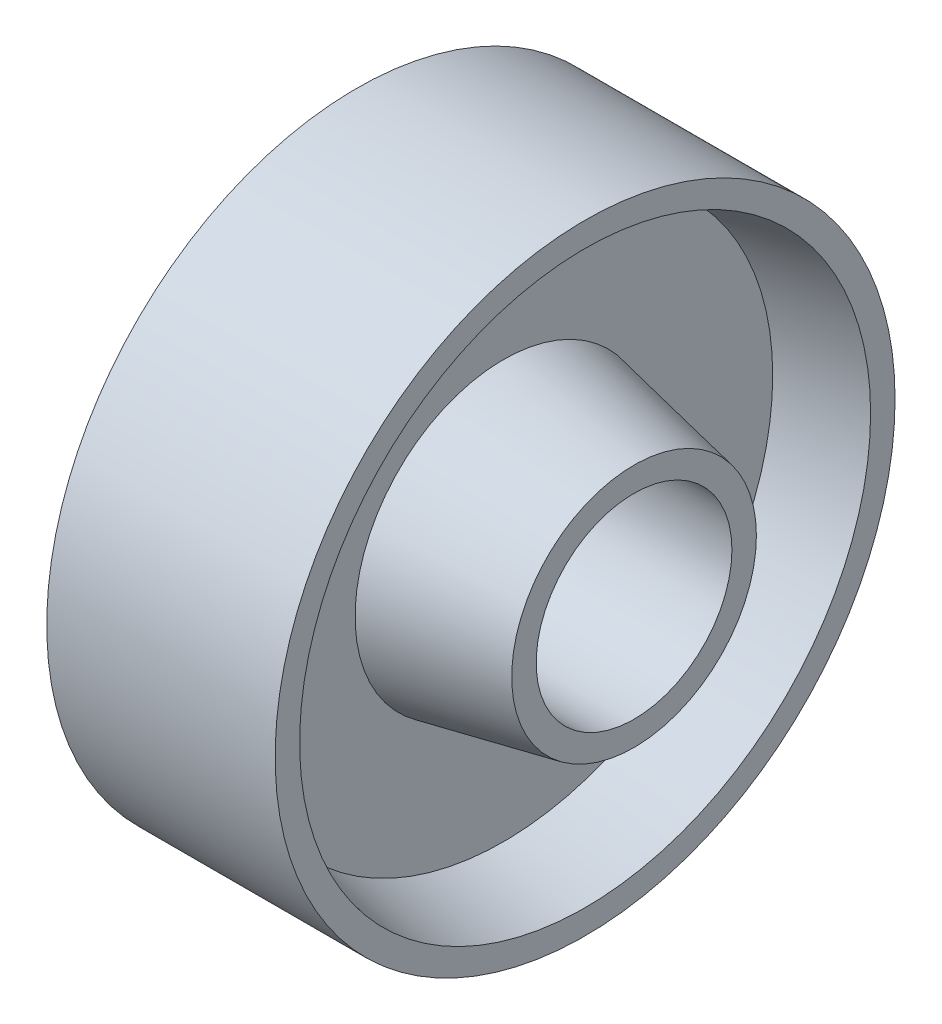
ISO-10303-21;
HEADER;
FILE_DESCRIPTION(('STEP AP214'),'2;1');
FILE_NAME('part.step','',(''),(''),'','','');
FILE_SCHEMA(('AUTOMOTIVE_DESIGN { 1 0 10303 214 1 1 1 1 }'));
ENDSEC;
DATA;
#1=APPLICATION_CONTEXT('core data for automotive mechanical design processes');
#2=APPLICATION_PROTOCOL_DEFINITION('international standard','automotive_design',2000,#1);
#3=PRODUCT_CONTEXT('',#1,'mechanical');
#4=PRODUCT('Part','Part','',(#3));
#5=PRODUCT_RELATED_PRODUCT_CATEGORY('part','',(#4));
#6=PRODUCT_DEFINITION_FORMATION('','',#4);
#7=PRODUCT_DEFINITION_CONTEXT('part definition',#1,'design');
#8=PRODUCT_DEFINITION('design','',#6,#7);
#9=PRODUCT_DEFINITION_SHAPE('','',#8);
#10=(LENGTH_UNIT() NAMED_UNIT(*) SI_UNIT(.MILLI.,.METRE.));
#11=(NAMED_UNIT(*) PLANE_ANGLE_UNIT() SI_UNIT($,.RADIAN.));
#12=(NAMED_UNIT(*) SI_UNIT($,.STERADIAN.) SOLID_ANGLE_UNIT());
#13=UNCERTAINTY_MEASURE_WITH_UNIT(LENGTH_MEASURE(1.E-05),#10,'distance_accuracy_value','');
#14=(GEOMETRIC_REPRESENTATION_CONTEXT(3) GLOBAL_UNCERTAINTY_ASSIGNED_CONTEXT((#13)) GLOBAL_UNIT_ASSIGNED_CONTEXT((#10,
#11,#12)) REPRESENTATION_CONTEXT('',''));
#15=CARTESIAN_POINT('',(0.,0.,0.));
#16=DIRECTION('',(0.,0.,1.));
#17=DIRECTION('',(1.,0.,0.));
#18=AXIS2_PLACEMENT_3D('',#15,#16,#17);
#19=CARTESIAN_POINT('',(20.,0.,0.));
#20=DIRECTION('',(-1.,0.,0.));
#21=DIRECTION('',(0.,0.,1.));
#22=AXIS2_PLACEMENT_3D('',#19,#20,#21);
#23=CONICAL_SURFACE('',#22,15.,0.197395559849881);
#24=CARTESIAN_POINT('',(4.,0.,0.));
#25=DIRECTION('',(1.,0.,0.));
#26=DIRECTION('',(0.,0.,-1.));
#27=AXIS2_PLACEMENT_3D('',#24,#25,#26);
#28=CIRCLE('',#27,18.2);
#29=CARTESIAN_POINT('',(4.,0.,-18.2));
#30=VERTEX_POINT('',#29);
#31=EDGE_CURVE('E71',#30,#30,#28,.T.);
#32=ORIENTED_EDGE('',*,*,#31,.T.);
#33=EDGE_LOOP('',(#32));
#34=FACE_BOUND('',#33,.T.);
#35=CARTESIAN_POINT('',(20.,0.,0.));
#36=DIRECTION('',(1.,0.,0.));
#37=DIRECTION('',(0.,0.,-1.));
#38=AXIS2_PLACEMENT_3D('',#35,#36,#37);
#39=CIRCLE('',#38,15.);
#40=CARTESIAN_POINT('',(20.,0.,-15.));
#41=VERTEX_POINT('',#40);
#42=EDGE_CURVE('E10',#41,#41,#39,.T.);
#43=ORIENTED_EDGE('',*,*,#42,.F.);
#44=EDGE_LOOP('',(#43));
#45=FACE_BOUND('',#44,.T.);
#46=ADVANCED_FACE('F31',(#34,#45),#23,.T.);
#47=CARTESIAN_POINT('',(20.,15.,0.));
#48=DIRECTION('',(1.,0.,0.));
#49=DIRECTION('',(0.,0.,-1.));
#50=AXIS2_PLACEMENT_3D('',#47,#48,#49);
#51=PLANE('',#50);
#52=ORIENTED_EDGE('',*,*,#42,.T.);
#53=EDGE_LOOP('',(#52));
#54=FACE_BOUND('',#53,.T.);
#55=CARTESIAN_POINT('',(20.,0.,0.));
#56=DIRECTION('',(1.,0.,0.));
#57=DIRECTION('',(0.,0.,-1.));
#58=AXIS2_PLACEMENT_3D('',#55,#56,#57);
#59=CIRCLE('',#58,12.);
#60=CARTESIAN_POINT('',(20.,0.,-12.));
#61=VERTEX_POINT('',#60);
#62=EDGE_CURVE('E37',#61,#61,#59,.T.);
#63=ORIENTED_EDGE('',*,*,#62,.F.);
#64=EDGE_LOOP('',(#63));
#65=FACE_BOUND('',#64,.T.);
#66=ADVANCED_FACE('F89',(#54,#65),#51,.T.);
#67=CARTESIAN_POINT('',(26.1021050496728,0.,0.));
#68=DIRECTION('',(1.,0.,0.));
#69=DIRECTION('',(0.,0.,-1.));
#70=AXIS2_PLACEMENT_3D('',#67,#68,#69);
#71=CYLINDRICAL_SURFACE('',#70,12.);
#72=ORIENTED_EDGE('',*,*,#62,.T.);
#73=EDGE_LOOP('',(#72));
#74=FACE_BOUND('',#73,.T.);
#75=CARTESIAN_POINT('',(-20.,0.,0.));
#76=DIRECTION('',(1.,0.,0.));
#77=DIRECTION('',(0.,0.,-1.));
#78=AXIS2_PLACEMENT_3D('',#75,#76,#77);
#79=CIRCLE('',#78,12.);
#80=CARTESIAN_POINT('',(-20.,0.,-12.));
#81=VERTEX_POINT('',#80);
#82=EDGE_CURVE('E41',#81,#81,#79,.T.);
#83=ORIENTED_EDGE('',*,*,#82,.F.);
#84=EDGE_LOOP('',(#83));
#85=FACE_BOUND('',#84,.T.);
#86=ADVANCED_FACE('F93',(#74,#85),#71,.F.);
#87=CARTESIAN_POINT('',(-20.,15.,0.));
#88=DIRECTION('',(-1.,0.,0.));
#89=DIRECTION('',(0.,0.,1.));
#90=AXIS2_PLACEMENT_3D('',#87,#88,#89);
#91=PLANE('',#90);
#92=ORIENTED_EDGE('',*,*,#82,.T.);
#93=EDGE_LOOP('',(#92));
#94=FACE_BOUND('',#93,.T.);
#95=CARTESIAN_POINT('',(-20.,0.,0.));
#96=DIRECTION('',(1.,0.,0.));
#97=DIRECTION('',(0.,0.,-1.));
#98=AXIS2_PLACEMENT_3D('',#95,#96,#97);
#99=CIRCLE('',#98,15.);
#100=CARTESIAN_POINT('',(-20.,0.,-15.));
#101=VERTEX_POINT('',#100);
#102=EDGE_CURVE('E45',#101,#101,#99,.T.);
#103=ORIENTED_EDGE('',*,*,#102,.F.);
#104=EDGE_LOOP('',(#103));
#105=FACE_BOUND('',#104,.T.);
#106=ADVANCED_FACE('F97',(#94,#105),#91,.T.);
#107=CARTESIAN_POINT('',(-4.,0.,0.));
#108=DIRECTION('',(1.,0.,0.));
#109=DIRECTION('',(0.,0.,-1.));
#110=AXIS2_PLACEMENT_3D('',#107,#108,#109);
#111=CONICAL_SURFACE('',#110,18.2,0.197395559849881);
#112=ORIENTED_EDGE('',*,*,#102,.T.);
#113=EDGE_LOOP('',(#112));
#114=FACE_BOUND('',#113,.T.);
#115=CARTESIAN_POINT('',(-4.,0.,0.));
#116=DIRECTION('',(1.,0.,0.));
#117=DIRECTION('',(0.,0.,-1.));
#118=AXIS2_PLACEMENT_3D('',#115,#116,#117);
#119=CIRCLE('',#118,18.2);
#120=CARTESIAN_POINT('',(-4.,0.,-18.2));
#121=VERTEX_POINT('',#120);
#122=EDGE_CURVE('E50',#121,#121,#119,.T.);
#123=ORIENTED_EDGE('',*,*,#122,.F.);
#124=EDGE_LOOP('',(#123));
#125=FACE_BOUND('',#124,.T.);
#126=ADVANCED_FACE('F103',(#114,#125),#111,.T.);
#127=CARTESIAN_POINT('',(-4.,18.2,0.));
#128=DIRECTION('',(-1.,0.,0.));
#129=DIRECTION('',(0.,0.,1.));
#130=AXIS2_PLACEMENT_3D('',#127,#128,#129);
#131=PLANE('',#130);
#132=ORIENTED_EDGE('',*,*,#122,.T.);
#133=EDGE_LOOP('',(#132));
#134=FACE_BOUND('',#133,.T.);
#135=CARTESIAN_POINT('',(-4.,0.,0.));
#136=DIRECTION('',(1.,0.,0.));
#137=DIRECTION('',(0.,0.,-1.));
#138=AXIS2_PLACEMENT_3D('',#135,#136,#137);
#139=CIRCLE('',#138,33.);
#140=CARTESIAN_POINT('',(-4.,0.,-33.));
#141=VERTEX_POINT('',#140);
#142=EDGE_CURVE('E53',#141,#141,#139,.T.);
#143=ORIENTED_EDGE('',*,*,#142,.F.);
#144=EDGE_LOOP('',(#143));
#145=FACE_BOUND('',#144,.T.);
#146=ADVANCED_FACE('F107',(#134,#145),#131,.T.);
#147=CARTESIAN_POINT('',(-14.,0.,0.));
#148=DIRECTION('',(-1.,0.,0.));
#149=DIRECTION('',(0.,0.,1.));
#150=AXIS2_PLACEMENT_3D('',#147,#148,#149);
#151=CONICAL_SURFACE('',#150,35.,0.197395559849881);
#152=ORIENTED_EDGE('',*,*,#142,.T.);
#153=EDGE_LOOP('',(#152));
#154=FACE_BOUND('',#153,.T.);
#155=CARTESIAN_POINT('',(-14.,0.,0.));
#156=DIRECTION('',(1.,0.,0.));
#157=DIRECTION('',(0.,0.,-1.));
#158=AXIS2_PLACEMENT_3D('',#155,#156,#157);
#159=CIRCLE('',#158,35.);
#160=CARTESIAN_POINT('',(-14.,0.,-35.));
#161=VERTEX_POINT('',#160);
#162=EDGE_CURVE('E56',#161,#161,#159,.T.);
#163=ORIENTED_EDGE('',*,*,#162,.F.);
#164=EDGE_LOOP('',(#163));
#165=FACE_BOUND('',#164,.T.);
#166=ADVANCED_FACE('F111',(#154,#165),#151,.F.);
#167=CARTESIAN_POINT('',(-14.,35.,0.));
#168=DIRECTION('',(-1.,0.,0.));
#169=DIRECTION('',(0.,0.,1.));
#170=AXIS2_PLACEMENT_3D('',#167,#168,#169);
#171=PLANE('',#170);
#172=ORIENTED_EDGE('',*,*,#162,.T.);
#173=EDGE_LOOP('',(#172));
#174=FACE_BOUND('',#173,.T.);
#175=CARTESIAN_POINT('',(-14.,0.,0.));
#176=DIRECTION('',(1.,0.,0.));
#177=DIRECTION('',(0.,0.,-1.));
#178=AXIS2_PLACEMENT_3D('',#175,#176,#177);
#179=CIRCLE('',#178,38.);
#180=CARTESIAN_POINT('',(-14.,0.,-38.));
#181=VERTEX_POINT('',#180);
#182=EDGE_CURVE('E59',#181,#181,#179,.T.);
#183=ORIENTED_EDGE('',*,*,#182,.F.);
#184=EDGE_LOOP('',(#183));
#185=FACE_BOUND('',#184,.T.);
#186=ADVANCED_FACE('F115',(#174,#185),#171,.T.);
#187=CARTESIAN_POINT('',(26.1021050496728,0.,0.));
#188=DIRECTION('',(1.,0.,0.));
#189=DIRECTION('',(0.,0.,-1.));
#190=AXIS2_PLACEMENT_3D('',#187,#188,#189);
#191=CYLINDRICAL_SURFACE('',#190,38.);
#192=ORIENTED_EDGE('',*,*,#182,.T.);
#193=EDGE_LOOP('',(#192));
#194=FACE_BOUND('',#193,.T.);
#195=CARTESIAN_POINT('',(14.,0.,0.));
#196=DIRECTION('',(1.,0.,0.));
#197=DIRECTION('',(0.,0.,-1.));
#198=AXIS2_PLACEMENT_3D('',#195,#196,#197);
#199=CIRCLE('',#198,38.);
#200=CARTESIAN_POINT('',(14.,0.,-38.));
#201=VERTEX_POINT('',#200);
#202=EDGE_CURVE('E62',#201,#201,#199,.T.);
#203=ORIENTED_EDGE('',*,*,#202,.F.);
#204=EDGE_LOOP('',(#203));
#205=FACE_BOUND('',#204,.T.);
#206=ADVANCED_FACE('F119',(#194,#205),#191,.T.);
#207=CARTESIAN_POINT('',(14.,35.,0.));
#208=DIRECTION('',(1.,0.,0.));
#209=DIRECTION('',(0.,0.,-1.));
#210=AXIS2_PLACEMENT_3D('',#207,#208,#209);
#211=PLANE('',#210);
#212=ORIENTED_EDGE('',*,*,#202,.T.);
#213=EDGE_LOOP('',(#212));
#214=FACE_BOUND('',#213,.T.);
#215=CARTESIAN_POINT('',(14.,0.,0.));
#216=DIRECTION('',(1.,0.,0.));
#217=DIRECTION('',(0.,0.,-1.));
#218=AXIS2_PLACEMENT_3D('',#215,#216,#217);
#219=CIRCLE('',#218,35.);
#220=CARTESIAN_POINT('',(14.,0.,-35.));
#221=VERTEX_POINT('',#220);
#222=EDGE_CURVE('E65',#221,#221,#219,.T.);
#223=ORIENTED_EDGE('',*,*,#222,.F.);
#224=EDGE_LOOP('',(#223));
#225=FACE_BOUND('',#224,.T.);
#226=ADVANCED_FACE('F85',(#214,#225),#211,.T.);
#227=CARTESIAN_POINT('',(4.,0.,0.));
#228=DIRECTION('',(1.,0.,0.));
#229=DIRECTION('',(0.,0.,-1.));
#230=AXIS2_PLACEMENT_3D('',#227,#228,#229);
#231=CONICAL_SURFACE('',#230,33.,0.197395559849881);
#232=ORIENTED_EDGE('',*,*,#222,.T.);
#233=EDGE_LOOP('',(#232));
#234=FACE_BOUND('',#233,.T.);
#235=CARTESIAN_POINT('',(4.,0.,0.));
#236=DIRECTION('',(1.,0.,0.));
#237=DIRECTION('',(0.,0.,-1.));
#238=AXIS2_PLACEMENT_3D('',#235,#236,#237);
#239=CIRCLE('',#238,33.);
#240=CARTESIAN_POINT('',(4.,0.,-33.));
#241=VERTEX_POINT('',#240);
#242=EDGE_CURVE('E68',#241,#241,#239,.T.);
#243=ORIENTED_EDGE('',*,*,#242,.F.);
#244=EDGE_LOOP('',(#243));
#245=FACE_BOUND('',#244,.T.);
#246=ADVANCED_FACE('F79',(#234,#245),#231,.F.);
#247=CARTESIAN_POINT('',(4.,18.2,0.));
#248=DIRECTION('',(1.,0.,0.));
#249=DIRECTION('',(0.,0.,-1.));
#250=AXIS2_PLACEMENT_3D('',#247,#248,#249);
#251=PLANE('',#250);
#252=ORIENTED_EDGE('',*,*,#242,.T.);
#253=EDGE_LOOP('',(#252));
#254=FACE_BOUND('',#253,.T.);
#255=ORIENTED_EDGE('',*,*,#31,.F.);
#256=EDGE_LOOP('',(#255));
#257=FACE_BOUND('',#256,.T.);
#258=ADVANCED_FACE('F77',(#254,#257),#251,.T.);
#259=CLOSED_SHELL('',(#46,#66,#86,#106,#126,#146,#166,#186,#206,#226,#246,#258));
#260=MANIFOLD_SOLID_BREP('B2',#259);
#261=ADVANCED_BREP_SHAPE_REPRESENTATION('',(#18,#260),#14);
#262=SHAPE_DEFINITION_REPRESENTATION(#9,#261);
ENDSEC;
END-ISO-10303-21;
